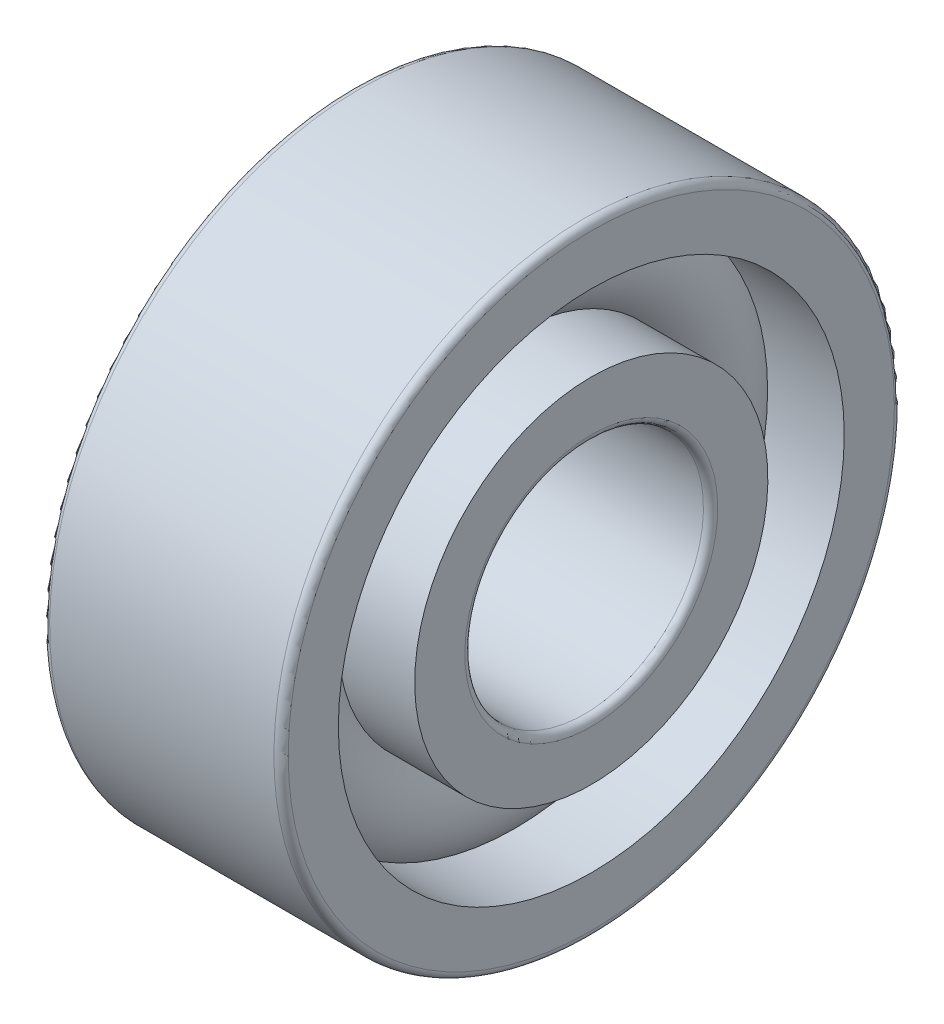
ISO-10303-21;
HEADER;
FILE_DESCRIPTION(('STEP AP214'),'2;1');
FILE_NAME('part.step','',(''),(''),'','','');
FILE_SCHEMA(('AUTOMOTIVE_DESIGN { 1 0 10303 214 1 1 1 1 }'));
ENDSEC;
DATA;
#1=APPLICATION_CONTEXT('core data for automotive mechanical design processes');
#2=APPLICATION_PROTOCOL_DEFINITION('international standard','automotive_design',2000,#1);
#3=PRODUCT_CONTEXT('',#1,'mechanical');
#4=PRODUCT('Part','Part','',(#3));
#5=PRODUCT_RELATED_PRODUCT_CATEGORY('part','',(#4));
#6=PRODUCT_DEFINITION_FORMATION('','',#4);
#7=PRODUCT_DEFINITION_CONTEXT('part definition',#1,'design');
#8=PRODUCT_DEFINITION('design','',#6,#7);
#9=PRODUCT_DEFINITION_SHAPE('','',#8);
#10=(LENGTH_UNIT() NAMED_UNIT(*) SI_UNIT(.MILLI.,.METRE.));
#11=(NAMED_UNIT(*) PLANE_ANGLE_UNIT() SI_UNIT($,.RADIAN.));
#12=(NAMED_UNIT(*) SI_UNIT($,.STERADIAN.) SOLID_ANGLE_UNIT());
#13=UNCERTAINTY_MEASURE_WITH_UNIT(LENGTH_MEASURE(1.E-05),#10,'distance_accuracy_value','');
#14=(GEOMETRIC_REPRESENTATION_CONTEXT(3) GLOBAL_UNCERTAINTY_ASSIGNED_CONTEXT((#13)) GLOBAL_UNIT_ASSIGNED_CONTEXT((#10,
#11,#12)) REPRESENTATION_CONTEXT('',''));
#15=CARTESIAN_POINT('',(0.,0.,0.));
#16=DIRECTION('',(0.,0.,1.));
#17=DIRECTION('',(1.,0.,0.));
#18=AXIS2_PLACEMENT_3D('',#15,#16,#17);
#19=CARTESIAN_POINT('',(0.,0.,0.));
#20=DIRECTION('',(-1.,0.,0.));
#21=DIRECTION('',(0.,-1.,0.));
#22=AXIS2_PLACEMENT_3D('',#19,#20,#21);
#23=TOROIDAL_SURFACE('',#22,9.,2.4);
#24=CARTESIAN_POINT('',(1.78885438199983,0.,0.));
#25=DIRECTION('',(-1.,0.,0.));
#26=DIRECTION('',(0.,-1.,0.));
#27=AXIS2_PLACEMENT_3D('',#24,#25,#26);
#28=CIRCLE('',#27,10.6);
#29=CARTESIAN_POINT('',(1.78885438199983,-10.6,0.));
#30=VERTEX_POINT('',#29);
#31=EDGE_CURVE('E10',#30,#30,#28,.F.);
#32=ORIENTED_EDGE('',*,*,#31,.T.);
#33=EDGE_LOOP('',(#32));
#34=FACE_BOUND('',#33,.T.);
#35=CARTESIAN_POINT('',(1.78885438199983,0.,0.));
#36=DIRECTION('',(-1.,0.,0.));
#37=DIRECTION('',(0.,-1.,0.));
#38=AXIS2_PLACEMENT_3D('',#35,#36,#37);
#39=CIRCLE('',#38,7.4);
#40=CARTESIAN_POINT('',(1.78885438199983,-7.4,0.));
#41=VERTEX_POINT('',#40);
#42=EDGE_CURVE('E22',#41,#41,#39,.T.);
#43=ORIENTED_EDGE('',*,*,#42,.T.);
#44=EDGE_LOOP('',(#43));
#45=FACE_BOUND('',#44,.T.);
#46=ADVANCED_FACE('F15',(#34,#45),#23,.T.);
#47=CARTESIAN_POINT('',(-20.6375,0.,0.));
#48=DIRECTION('',(1.,0.,0.));
#49=DIRECTION('',(0.,1.,0.));
#50=AXIS2_PLACEMENT_3D('',#47,#48,#49);
#51=CYLINDRICAL_SURFACE('',#50,7.4);
#52=CARTESIAN_POINT('',(5.,0.,0.));
#53=DIRECTION('',(1.,0.,0.));
#54=DIRECTION('',(0.,1.,0.));
#55=AXIS2_PLACEMENT_3D('',#52,#53,#54);
#56=CIRCLE('',#55,7.4);
#57=CARTESIAN_POINT('',(5.,7.4,0.));
#58=VERTEX_POINT('',#57);
#59=EDGE_CURVE('E29',#58,#58,#56,.T.);
#60=ORIENTED_EDGE('',*,*,#59,.F.);
#61=EDGE_LOOP('',(#60));
#62=FACE_BOUND('',#61,.T.);
#63=ORIENTED_EDGE('',*,*,#42,.F.);
#64=EDGE_LOOP('',(#63));
#65=FACE_BOUND('',#64,.T.);
#66=ADVANCED_FACE('F106',(#62,#65),#51,.T.);
#67=CARTESIAN_POINT('',(-20.6375,0.,0.));
#68=DIRECTION('',(1.,0.,0.));
#69=DIRECTION('',(0.,1.,0.));
#70=AXIS2_PLACEMENT_3D('',#67,#68,#69);
#71=CYLINDRICAL_SURFACE('',#70,7.4);
#72=CARTESIAN_POINT('',(-5.,0.,0.));
#73=DIRECTION('',(1.,0.,0.));
#74=DIRECTION('',(0.,1.,0.));
#75=AXIS2_PLACEMENT_3D('',#72,#73,#74);
#76=CIRCLE('',#75,7.4);
#77=CARTESIAN_POINT('',(-5.,7.4,0.));
#78=VERTEX_POINT('',#77);
#79=EDGE_CURVE('E35',#78,#78,#76,.T.);
#80=ORIENTED_EDGE('',*,*,#79,.T.);
#81=EDGE_LOOP('',(#80));
#82=FACE_BOUND('',#81,.T.);
#83=CARTESIAN_POINT('',(-1.78885438199983,0.,0.));
#84=DIRECTION('',(1.,0.,0.));
#85=DIRECTION('',(0.,1.,0.));
#86=AXIS2_PLACEMENT_3D('',#83,#84,#85);
#87=CIRCLE('',#86,7.4);
#88=CARTESIAN_POINT('',(-1.78885438199983,7.4,0.));
#89=VERTEX_POINT('',#88);
#90=EDGE_CURVE('E41',#89,#89,#87,.T.);
#91=ORIENTED_EDGE('',*,*,#90,.F.);
#92=EDGE_LOOP('',(#91));
#93=FACE_BOUND('',#92,.T.);
#94=ADVANCED_FACE('F110',(#82,#93),#71,.T.);
#95=CARTESIAN_POINT('',(5.,0.,5.3));
#96=DIRECTION('',(1.,0.,0.));
#97=DIRECTION('',(0.,1.,0.));
#98=AXIS2_PLACEMENT_3D('',#95,#96,#97);
#99=PLANE('',#98);
#100=ORIENTED_EDGE('',*,*,#59,.T.);
#101=EDGE_LOOP('',(#100));
#102=FACE_BOUND('',#101,.T.);
#103=CARTESIAN_POINT('',(5.,0.,0.));
#104=DIRECTION('',(1.,0.,0.));
#105=DIRECTION('',(0.,1.,0.));
#106=AXIS2_PLACEMENT_3D('',#103,#104,#105);
#107=CIRCLE('',#106,5.3);
#108=CARTESIAN_POINT('',(5.,5.3,0.));
#109=VERTEX_POINT('',#108);
#110=EDGE_CURVE('E45',#109,#109,#107,.T.);
#111=ORIENTED_EDGE('',*,*,#110,.F.);
#112=EDGE_LOOP('',(#111));
#113=FACE_BOUND('',#112,.T.);
#114=ADVANCED_FACE('F115',(#102,#113),#99,.T.);
#115=CARTESIAN_POINT('',(4.7,0.,0.));
#116=DIRECTION('',(1.,0.,0.));
#117=DIRECTION('',(0.,1.,0.));
#118=AXIS2_PLACEMENT_3D('',#115,#116,#117);
#119=TOROIDAL_SURFACE('',#118,5.3,0.3);
#120=ORIENTED_EDGE('',*,*,#110,.T.);
#121=EDGE_LOOP('',(#120));
#122=FACE_BOUND('',#121,.T.);
#123=CARTESIAN_POINT('',(4.7,0.,0.));
#124=DIRECTION('',(1.,0.,0.));
#125=DIRECTION('',(0.,1.,0.));
#126=AXIS2_PLACEMENT_3D('',#123,#124,#125);
#127=CIRCLE('',#126,5.);
#128=CARTESIAN_POINT('',(4.7,5.,0.));
#129=VERTEX_POINT('',#128);
#130=EDGE_CURVE('E49',#129,#129,#127,.T.);
#131=ORIENTED_EDGE('',*,*,#130,.F.);
#132=EDGE_LOOP('',(#131));
#133=FACE_BOUND('',#132,.T.);
#134=ADVANCED_FACE('F123',(#122,#133),#119,.T.);
#135=CARTESIAN_POINT('',(-20.6375,0.,0.));
#136=DIRECTION('',(1.,0.,0.));
#137=DIRECTION('',(0.,1.,0.));
#138=AXIS2_PLACEMENT_3D('',#135,#136,#137);
#139=CYLINDRICAL_SURFACE('',#138,5.);
#140=ORIENTED_EDGE('',*,*,#130,.T.);
#141=EDGE_LOOP('',(#140));
#142=FACE_BOUND('',#141,.T.);
#143=CARTESIAN_POINT('',(-4.7,0.,0.));
#144=DIRECTION('',(1.,0.,0.));
#145=DIRECTION('',(0.,1.,0.));
#146=AXIS2_PLACEMENT_3D('',#143,#144,#145);
#147=CIRCLE('',#146,5.);
#148=CARTESIAN_POINT('',(-4.7,5.,0.));
#149=VERTEX_POINT('',#148);
#150=EDGE_CURVE('E53',#149,#149,#147,.T.);
#151=ORIENTED_EDGE('',*,*,#150,.F.);
#152=EDGE_LOOP('',(#151));
#153=FACE_BOUND('',#152,.T.);
#154=ADVANCED_FACE('F127',(#142,#153),#139,.F.);
#155=CARTESIAN_POINT('',(-4.7,0.,0.));
#156=DIRECTION('',(1.,0.,0.));
#157=DIRECTION('',(0.,1.,0.));
#158=AXIS2_PLACEMENT_3D('',#155,#156,#157);
#159=TOROIDAL_SURFACE('',#158,5.3,0.3);
#160=ORIENTED_EDGE('',*,*,#150,.T.);
#161=EDGE_LOOP('',(#160));
#162=FACE_BOUND('',#161,.T.);
#163=CARTESIAN_POINT('',(-5.,0.,0.));
#164=DIRECTION('',(1.,0.,0.));
#165=DIRECTION('',(0.,1.,0.));
#166=AXIS2_PLACEMENT_3D('',#163,#164,#165);
#167=CIRCLE('',#166,5.3);
#168=CARTESIAN_POINT('',(-5.,5.3,0.));
#169=VERTEX_POINT('',#168);
#170=EDGE_CURVE('E57',#169,#169,#167,.T.);
#171=ORIENTED_EDGE('',*,*,#170,.F.);
#172=EDGE_LOOP('',(#171));
#173=FACE_BOUND('',#172,.T.);
#174=ADVANCED_FACE('F131',(#162,#173),#159,.T.);
#175=CARTESIAN_POINT('',(-5.,0.,7.4));
#176=DIRECTION('',(-1.,0.,0.));
#177=DIRECTION('',(0.,-1.,0.));
#178=AXIS2_PLACEMENT_3D('',#175,#176,#177);
#179=PLANE('',#178);
#180=ORIENTED_EDGE('',*,*,#170,.T.);
#181=EDGE_LOOP('',(#180));
#182=FACE_BOUND('',#181,.T.);
#183=ORIENTED_EDGE('',*,*,#79,.F.);
#184=EDGE_LOOP('',(#183));
#185=FACE_BOUND('',#184,.T.);
#186=ADVANCED_FACE('F135',(#182,#185),#179,.T.);
#187=CARTESIAN_POINT('',(0.,0.,0.));
#188=DIRECTION('',(-1.,0.,0.));
#189=DIRECTION('',(0.,-1.,0.));
#190=AXIS2_PLACEMENT_3D('',#187,#188,#189);
#191=TOROIDAL_SURFACE('',#190,9.,2.4);
#192=CARTESIAN_POINT('',(-1.78885438199983,0.,0.));
#193=DIRECTION('',(1.,0.,0.));
#194=DIRECTION('',(0.,1.,0.));
#195=AXIS2_PLACEMENT_3D('',#192,#193,#194);
#196=CIRCLE('',#195,10.6);
#197=CARTESIAN_POINT('',(-1.78885438199983,10.6,0.));
#198=VERTEX_POINT('',#197);
#199=EDGE_CURVE('E61',#198,#198,#196,.F.);
#200=ORIENTED_EDGE('',*,*,#199,.T.);
#201=EDGE_LOOP('',(#200));
#202=FACE_BOUND('',#201,.T.);
#203=ORIENTED_EDGE('',*,*,#90,.T.);
#204=EDGE_LOOP('',(#203));
#205=FACE_BOUND('',#204,.T.);
#206=ADVANCED_FACE('F139',(#202,#205),#191,.T.);
#207=CARTESIAN_POINT('',(-20.6375,0.,0.));
#208=DIRECTION('',(1.,0.,0.));
#209=DIRECTION('',(0.,1.,0.));
#210=AXIS2_PLACEMENT_3D('',#207,#208,#209);
#211=CYLINDRICAL_SURFACE('',#210,10.6);
#212=CARTESIAN_POINT('',(5.,0.,0.));
#213=DIRECTION('',(1.,0.,0.));
#214=DIRECTION('',(0.,1.,0.));
#215=AXIS2_PLACEMENT_3D('',#212,#213,#214);
#216=CIRCLE('',#215,10.6);
#217=CARTESIAN_POINT('',(5.,10.6,0.));
#218=VERTEX_POINT('',#217);
#219=EDGE_CURVE('E65',#218,#218,#216,.T.);
#220=ORIENTED_EDGE('',*,*,#219,.T.);
#221=EDGE_LOOP('',(#220));
#222=FACE_BOUND('',#221,.T.);
#223=ORIENTED_EDGE('',*,*,#31,.F.);
#224=EDGE_LOOP('',(#223));
#225=FACE_BOUND('',#224,.T.);
#226=ADVANCED_FACE('F143',(#222,#225),#211,.F.);
#227=CARTESIAN_POINT('',(-20.6375,0.,0.));
#228=DIRECTION('',(1.,0.,0.));
#229=DIRECTION('',(0.,1.,0.));
#230=AXIS2_PLACEMENT_3D('',#227,#228,#229);
#231=CYLINDRICAL_SURFACE('',#230,10.6);
#232=CARTESIAN_POINT('',(-5.,0.,0.));
#233=DIRECTION('',(1.,0.,0.));
#234=DIRECTION('',(0.,1.,0.));
#235=AXIS2_PLACEMENT_3D('',#232,#233,#234);
#236=CIRCLE('',#235,10.6);
#237=CARTESIAN_POINT('',(-5.,10.6,0.));
#238=VERTEX_POINT('',#237);
#239=EDGE_CURVE('E69',#238,#238,#236,.T.);
#240=ORIENTED_EDGE('',*,*,#239,.F.);
#241=EDGE_LOOP('',(#240));
#242=FACE_BOUND('',#241,.T.);
#243=ORIENTED_EDGE('',*,*,#199,.F.);
#244=EDGE_LOOP('',(#243));
#245=FACE_BOUND('',#244,.T.);
#246=ADVANCED_FACE('F147',(#242,#245),#231,.F.);
#247=CARTESIAN_POINT('',(5.,0.,12.7));
#248=DIRECTION('',(1.,0.,0.));
#249=DIRECTION('',(0.,1.,0.));
#250=AXIS2_PLACEMENT_3D('',#247,#248,#249);
#251=PLANE('',#250);
#252=CARTESIAN_POINT('',(5.,0.,0.));
#253=DIRECTION('',(1.,0.,0.));
#254=DIRECTION('',(0.,1.,0.));
#255=AXIS2_PLACEMENT_3D('',#252,#253,#254);
#256=CIRCLE('',#255,12.7);
#257=CARTESIAN_POINT('',(5.,12.7,0.));
#258=VERTEX_POINT('',#257);
#259=EDGE_CURVE('E73',#258,#258,#256,.T.);
#260=ORIENTED_EDGE('',*,*,#259,.T.);
#261=EDGE_LOOP('',(#260));
#262=FACE_BOUND('',#261,.T.);
#263=ORIENTED_EDGE('',*,*,#219,.F.);
#264=EDGE_LOOP('',(#263));
#265=FACE_BOUND('',#264,.T.);
#266=ADVANCED_FACE('F151',(#262,#265),#251,.T.);
#267=CARTESIAN_POINT('',(4.7,0.,0.));
#268=DIRECTION('',(1.,0.,0.));
#269=DIRECTION('',(0.,1.,0.));
#270=AXIS2_PLACEMENT_3D('',#267,#268,#269);
#271=TOROIDAL_SURFACE('',#270,12.7,0.3);
#272=CARTESIAN_POINT('',(4.7,0.,0.));
#273=DIRECTION('',(1.,0.,0.));
#274=DIRECTION('',(0.,1.,0.));
#275=AXIS2_PLACEMENT_3D('',#272,#273,#274);
#276=CIRCLE('',#275,13.);
#277=CARTESIAN_POINT('',(4.7,13.,0.));
#278=VERTEX_POINT('',#277);
#279=EDGE_CURVE('E77',#278,#278,#276,.T.);
#280=ORIENTED_EDGE('',*,*,#279,.T.);
#281=EDGE_LOOP('',(#280));
#282=FACE_BOUND('',#281,.T.);
#283=ORIENTED_EDGE('',*,*,#259,.F.);
#284=EDGE_LOOP('',(#283));
#285=FACE_BOUND('',#284,.T.);
#286=ADVANCED_FACE('F155',(#282,#285),#271,.T.);
#287=CARTESIAN_POINT('',(-20.6375,0.,0.));
#288=DIRECTION('',(1.,0.,0.));
#289=DIRECTION('',(0.,1.,0.));
#290=AXIS2_PLACEMENT_3D('',#287,#288,#289);
#291=CYLINDRICAL_SURFACE('',#290,13.);
#292=CARTESIAN_POINT('',(-4.7,0.,0.));
#293=DIRECTION('',(1.,0.,0.));
#294=DIRECTION('',(0.,1.,0.));
#295=AXIS2_PLACEMENT_3D('',#292,#293,#294);
#296=CIRCLE('',#295,13.);
#297=CARTESIAN_POINT('',(-4.7,13.,0.));
#298=VERTEX_POINT('',#297);
#299=EDGE_CURVE('E81',#298,#298,#296,.T.);
#300=ORIENTED_EDGE('',*,*,#299,.T.);
#301=EDGE_LOOP('',(#300));
#302=FACE_BOUND('',#301,.T.);
#303=ORIENTED_EDGE('',*,*,#279,.F.);
#304=EDGE_LOOP('',(#303));
#305=FACE_BOUND('',#304,.T.);
#306=ADVANCED_FACE('F103',(#302,#305),#291,.T.);
#307=CARTESIAN_POINT('',(-4.7,0.,0.));
#308=DIRECTION('',(1.,0.,0.));
#309=DIRECTION('',(0.,1.,0.));
#310=AXIS2_PLACEMENT_3D('',#307,#308,#309);
#311=TOROIDAL_SURFACE('',#310,12.7,0.3);
#312=CARTESIAN_POINT('',(-5.,0.,0.));
#313=DIRECTION('',(1.,0.,0.));
#314=DIRECTION('',(0.,1.,0.));
#315=AXIS2_PLACEMENT_3D('',#312,#313,#314);
#316=CIRCLE('',#315,12.7);
#317=CARTESIAN_POINT('',(-5.,12.7,0.));
#318=VERTEX_POINT('',#317);
#319=EDGE_CURVE('E85',#318,#318,#316,.T.);
#320=ORIENTED_EDGE('',*,*,#319,.T.);
#321=EDGE_LOOP('',(#320));
#322=FACE_BOUND('',#321,.T.);
#323=ORIENTED_EDGE('',*,*,#299,.F.);
#324=EDGE_LOOP('',(#323));
#325=FACE_BOUND('',#324,.T.);
#326=ADVANCED_FACE('F92',(#322,#325),#311,.T.);
#327=CARTESIAN_POINT('',(-5.,0.,10.6));
#328=DIRECTION('',(-1.,0.,0.));
#329=DIRECTION('',(0.,-1.,0.));
#330=AXIS2_PLACEMENT_3D('',#327,#328,#329);
#331=PLANE('',#330);
#332=ORIENTED_EDGE('',*,*,#239,.T.);
#333=EDGE_LOOP('',(#332));
#334=FACE_BOUND('',#333,.T.);
#335=ORIENTED_EDGE('',*,*,#319,.F.);
#336=EDGE_LOOP('',(#335));
#337=FACE_BOUND('',#336,.T.);
#338=ADVANCED_FACE('F95',(#334,#337),#331,.T.);
#339=CLOSED_SHELL('',(#46,#66,#94,#114,#134,#154,#174,#186,#206,#226,#246,#266,#286,#306,#326,#338));
#340=MANIFOLD_SOLID_BREP('B1',#339);
#341=ADVANCED_BREP_SHAPE_REPRESENTATION('',(#18,#340),#14);
#342=SHAPE_DEFINITION_REPRESENTATION(#9,#341);
ENDSEC;
END-ISO-10303-21;
